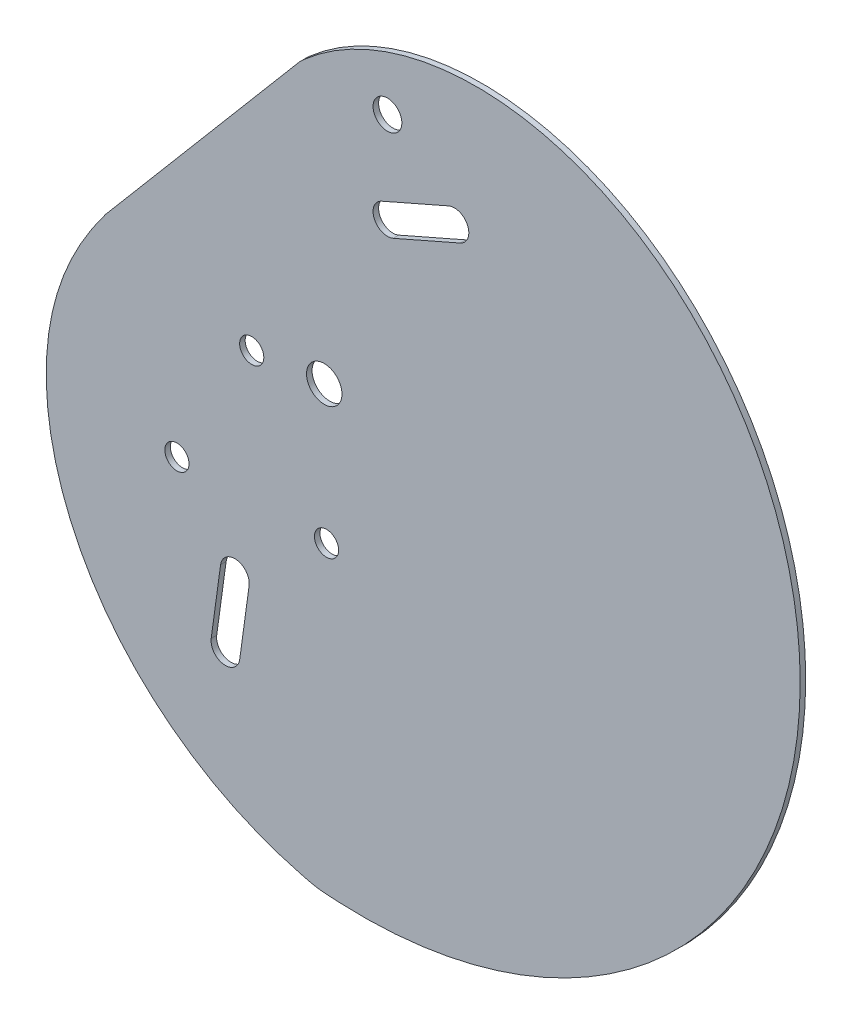
ISO-10303-21;
HEADER;
FILE_DESCRIPTION(('STEP AP214'),'2;1');
FILE_NAME('part.step','',(''),(''),'','','');
FILE_SCHEMA(('AUTOMOTIVE_DESIGN { 1 0 10303 214 1 1 1 1 }'));
ENDSEC;
DATA;
#1=APPLICATION_CONTEXT('core data for automotive mechanical design processes');
#2=APPLICATION_PROTOCOL_DEFINITION('international standard','automotive_design',2000,#1);
#3=PRODUCT_CONTEXT('',#1,'mechanical');
#4=PRODUCT('Part','Part','',(#3));
#5=PRODUCT_RELATED_PRODUCT_CATEGORY('part','',(#4));
#6=PRODUCT_DEFINITION_FORMATION('','',#4);
#7=PRODUCT_DEFINITION_CONTEXT('part definition',#1,'design');
#8=PRODUCT_DEFINITION('design','',#6,#7);
#9=PRODUCT_DEFINITION_SHAPE('','',#8);
#10=(LENGTH_UNIT() NAMED_UNIT(*) SI_UNIT(.MILLI.,.METRE.));
#11=(NAMED_UNIT(*) PLANE_ANGLE_UNIT() SI_UNIT($,.RADIAN.));
#12=(NAMED_UNIT(*) SI_UNIT($,.STERADIAN.) SOLID_ANGLE_UNIT());
#13=UNCERTAINTY_MEASURE_WITH_UNIT(LENGTH_MEASURE(1.E-05),#10,'distance_accuracy_value','');
#14=(GEOMETRIC_REPRESENTATION_CONTEXT(3) GLOBAL_UNCERTAINTY_ASSIGNED_CONTEXT((#13)) GLOBAL_UNIT_ASSIGNED_CONTEXT((#10,
#11,#12)) REPRESENTATION_CONTEXT('',''));
#15=CARTESIAN_POINT('',(0.,0.,0.));
#16=DIRECTION('',(0.,0.,1.));
#17=DIRECTION('',(1.,0.,0.));
#18=AXIS2_PLACEMENT_3D('',#15,#16,#17);
#19=CARTESIAN_POINT('',(-1.26128431869605,-76.3889966640853,0.479643116195787));
#20=CARTESIAN_POINT('',(-0.976706935574322,-76.433000958118,0.479643116195787));
#21=CARTESIAN_POINT('',(-0.40570033732491,-76.5002886734785,0.479643116195787));
#22=CARTESIAN_POINT('',(0.205282970299483,-76.5431286550552,0.479643116195787));
#23=CARTESIAN_POINT('',(0.635947632892369,-76.5659234882829,0.479643116195787));
#24=CARTESIAN_POINT('',(0.943803395898629,-76.5837536992732,0.479643116195787));
#25=CARTESIAN_POINT('',(1.51657766798327,-76.6253526449032,0.479643116195787));
#26=CARTESIAN_POINT('',(2.39472861708088,-76.6794226518138,0.479643116195787));
#27=CARTESIAN_POINT('',(3.1808192769605,-76.7137003743502,0.479643116195787));
#28=CARTESIAN_POINT('',(4.19803699961454,-76.75168724619,0.479643116195787));
#29=CARTESIAN_POINT('',(6.0521406389918,-76.7942720929503,0.479643116195787));
#30=CARTESIAN_POINT('',(8.65531896727179,-76.7757899651055,0.479643116195787));
#31=CARTESIAN_POINT('',(11.7992302850273,-76.631186753929,0.479643116195787));
#32=CARTESIAN_POINT('',(14.9308116076091,-76.362150817123,0.479643116195787));
#33=CARTESIAN_POINT('',(19.0927292822368,-75.8376989684194,0.479643116195787));
#34=CARTESIAN_POINT('',(24.2526003043896,-74.8709042385839,0.479643116195787));
#35=CARTESIAN_POINT('',(30.3366917936986,-73.2151665179252,0.479643116195787));
#36=CARTESIAN_POINT('',(38.2496377184228,-70.3553029330726,0.479643116195787));
#37=CARTESIAN_POINT('',(47.6646576679233,-65.5807106727296,0.479643116195787));
#38=CARTESIAN_POINT('',(57.8782405742599,-58.0526588499173,0.479643116195787));
#39=CARTESIAN_POINT('',(69.6472472290832,-45.8604490127679,0.479643116195787));
#40=CARTESIAN_POINT('',(80.1730162895738,-27.1334514768673,0.479643116195787));
#41=CARTESIAN_POINT('',(84.2538630410436,-1.50479165459522,0.479643116195787));
#42=CARTESIAN_POINT('',(79.5599947434369,19.8412067482863,0.479643116195787));
#43=CARTESIAN_POINT('',(70.8796865135484,34.9401638956233,0.479643116195787));
#44=CARTESIAN_POINT('',(62.021642873432,44.7053655266334,0.479643116195787));
#45=CARTESIAN_POINT('',(51.0907411074019,52.2640812116842,0.479643116195787));
#46=CARTESIAN_POINT('',(38.576471746608,57.0540859282341,0.479643116195787));
#47=CARTESIAN_POINT('',(25.1004774931715,58.5603822983813,0.479643116195787));
#48=CARTESIAN_POINT('',(13.7708368946147,56.6943293928139,0.479643116195787));
#49=CARTESIAN_POINT('',(5.22574400857566,53.179291685644,0.479643116195787));
#50=CARTESIAN_POINT('',(-0.75748548654271,49.5274645181489,0.479643116195787));
#51=CARTESIAN_POINT('',(-5.17982564226412,45.6481332259453,0.479643116195787));
#52=CARTESIAN_POINT('',(-8.21712868273601,42.3111233056651,0.479643116195787));
#53=CARTESIAN_POINT('',(-10.2837476793927,39.7285564460287,0.479643116195787));
#54=CARTESIAN_POINT('',(-12.1453981413637,37.1299230221057,0.479643116195787));
#55=CARTESIAN_POINT('',(-13.803593656072,34.6302202411006,0.479643116195787));
#56=CARTESIAN_POINT('',(-15.0263666385234,32.7872172676154,0.479643116195787));
#57=CARTESIAN_POINT('',(-15.757749026262,31.8150435741405,0.479643116195787));
#58=CARTESIAN_POINT('',(-16.4572837085939,31.0087975471452,0.479643116195787));
#59=CARTESIAN_POINT('',(-17.3148530430872,30.2124256121384,0.479643116195787));
#60=CARTESIAN_POINT('',(-18.8320987171928,29.1405411562789,0.479643116195787));
#61=CARTESIAN_POINT('',(-20.5794335453912,27.9210149954297,0.479643116195787));
#62=CARTESIAN_POINT('',(-21.8514483213816,26.9528121584477,0.479643116195787));
#63=CARTESIAN_POINT('',(-22.9229134864311,26.0255763335065,0.479643116195787));
#64=CARTESIAN_POINT('',(-23.9113330049711,25.0957745743073,0.479643116195787));
#65=CARTESIAN_POINT('',(-25.0438847891512,23.9057178105531,0.479643116195787));
#66=CARTESIAN_POINT('',(-26.2444451597005,22.4769501418682,0.479643116195787));
#67=CARTESIAN_POINT('',(-27.6678771544237,20.6032078316902,0.479643116195787));
#68=CARTESIAN_POINT('',(-29.1662720153948,18.3817060593167,0.479643116195787));
#69=CARTESIAN_POINT('',(-30.6820035254275,16.0304898055358,0.479643116195787));
#70=CARTESIAN_POINT('',(-31.8417450158577,14.3234191557175,0.479643116195787));
#71=CARTESIAN_POINT('',(-32.7929265221825,13.0258719381619,0.479643116195787));
#72=CARTESIAN_POINT('',(-33.7609917005133,11.7717771176703,0.479643116195787));
#73=CARTESIAN_POINT('',(-35.1935179417244,10.0318274989824,0.479643116195787));
#74=CARTESIAN_POINT('',(-37.0947743542895,7.68858611063458,0.479643116195787));
#75=CARTESIAN_POINT('',(-39.6505131759334,4.30610185058949,0.479643116195787));
#76=CARTESIAN_POINT('',(-42.6514237523282,-0.366044153239744,0.479643116195787));
#77=CARTESIAN_POINT('',(-45.5355557594005,-6.54725137287064,0.479643116195787));
#78=CARTESIAN_POINT('',(-47.5029702487626,-13.2116577754802,0.479643116195787));
#79=CARTESIAN_POINT('',(-48.6844974640878,-22.3699096817478,0.479643116195787));
#80=CARTESIAN_POINT('',(-47.6098868039418,-33.7322087237693,0.479643116195787));
#81=CARTESIAN_POINT('',(-42.8642408139455,-46.3451326435725,0.479643116195787));
#82=CARTESIAN_POINT('',(-36.5641298213063,-55.4680273522898,0.479643116195787));
#83=CARTESIAN_POINT('',(-30.4296575788591,-61.7275262732319,0.479643116195787));
#84=CARTESIAN_POINT('',(-25.3568115028753,-65.8672301951248,0.479643116195787));
#85=CARTESIAN_POINT('',(-20.7978951820845,-68.8298585097831,0.479643116195787));
#86=CARTESIAN_POINT('',(-16.9868888228126,-70.8972783811654,0.479643116195787));
#87=CARTESIAN_POINT('',(-14.0571261532245,-72.2940624730244,0.479643116195787));
#88=CARTESIAN_POINT('',(-11.0574897827893,-73.537247470639,0.479643116195787));
#89=CARTESIAN_POINT('',(-8.52863978148638,-74.4382486629739,0.479643116195787));
#90=CARTESIAN_POINT('',(-6.7053553577977,-75.0088395123344,0.479643116195787));
#91=CARTESIAN_POINT('',(-5.69991861950379,-75.3033007427362,0.479643116195787));
#92=CARTESIAN_POINT('',(-4.91466346108121,-75.5253296610727,0.479643116195787));
#93=CARTESIAN_POINT('',(-4.04372816904597,-75.7517503026063,0.479643116195787));
#94=CARTESIAN_POINT('',(-3.47701846483031,-75.8911528901832,0.479643116195787));
#95=CARTESIAN_POINT('',(-3.15620305968882,-75.9746877031505,0.479643116195787));
#96=CARTESIAN_POINT('',(-2.71872815087296,-76.0895979552755,0.479643116195787));
#97=CARTESIAN_POINT('',(-2.11316463605528,-76.2362629092826,0.479643116195787));
#98=CARTESIAN_POINT('',(-1.54586170181775,-76.3449923700527,0.479643116195787));
#99=CARTESIAN_POINT('',(-1.26128431869605,-76.3889966640853,0.479643116195787));
#100=B_SPLINE_CURVE_WITH_KNOTS('',3,(#19,#20,#21,#22,#23,#24,#25,#26,#27,#28,#29,#30,#31,#32,
#33,#34,#35,#36,#37,#38,#39,#40,#41,#42,#43,#44,#45,#46,#47,#48,#49,#50,#51,#52,#53,#54,#55,#56,
#57,#58,#59,#60,#61,#62,#63,#64,#65,#66,#67,#68,#69,#70,#71,#72,#73,#74,#75,#76,#77,#78,#79,#80,
#81,#82,#83,#84,#85,#86,#87,#88,#89,#90,#91,#92,#93,#94,#95,#96,#97,#98,#99),.UNSPECIFIED.,.T.,
.F.,(4,1,1,1,1,1,1,1,1,1,1,1,1,1,1,1,1,1,1,1,1,1,1,1,1,1,1,1,1,1,1,1,1,1,1,1,1,1,1,1,1,1,1,1,1,
1,1,1,1,1,1,1,1,1,1,1,1,1,1,1,1,1,1,1,1,1,1,1,1,1,1,1,1,1,1,1,1,1,4),(0.,0.0009765625,
0.001953125,0.0029296875,0.00390625,0.005859375,0.0078125,0.009765625,0.01171875,0.015625,
0.0234375,0.03125,0.0390625,0.046875,0.0625,0.078125,0.09375,0.125,0.15625,0.1875,0.25,0.3125,
0.375,0.40625,0.4375,0.46875,0.5,0.53125,0.5625,0.578125,0.59375,0.609375,0.6171875,0.625,
0.6328125,0.640625,0.6484375,0.65234375,0.65625,0.6640625,0.671875,0.67578125,0.6796875,
0.681640625,0.68359375,0.6875,0.69140625,0.6953125,0.703125,0.7109375,0.71875,0.72265625,
0.7265625,0.734375,0.7421875,0.75,0.765625,0.78125,0.796875,0.8125,0.84375,0.875,0.90625,
0.921875,0.9375,0.953125,0.9609375,0.96875,0.9765625,0.984375,0.98828125,0.990234375,0.9921875,
0.994140625,0.99609375,0.9970703125,0.998046875,0.9990234375,1.),.UNSPECIFIED.);
#101=DIRECTION('',(0.,0.,-1.));
#102=VECTOR('',#101,1.);
#103=SURFACE_OF_LINEAR_EXTRUSION('',#100,#102);
#104=CARTESIAN_POINT('',(-1.26128431869605,-76.3889966640853,-0.479643116195787));
#105=CARTESIAN_POINT('',(-0.976706935574322,-76.433000958118,-0.479643116195787));
#106=CARTESIAN_POINT('',(-0.40570033732491,-76.5002886734785,-0.479643116195787));
#107=CARTESIAN_POINT('',(0.205282970299483,-76.5431286550552,-0.479643116195787));
#108=CARTESIAN_POINT('',(0.635947632892369,-76.5659234882829,-0.479643116195787));
#109=CARTESIAN_POINT('',(0.943803395898629,-76.5837536992732,-0.479643116195787));
#110=CARTESIAN_POINT('',(1.51657766798327,-76.6253526449032,-0.479643116195787));
#111=CARTESIAN_POINT('',(2.39472861708088,-76.6794226518138,-0.479643116195787));
#112=CARTESIAN_POINT('',(3.1808192769605,-76.7137003743502,-0.479643116195787));
#113=CARTESIAN_POINT('',(4.19803699961454,-76.75168724619,-0.479643116195787));
#114=CARTESIAN_POINT('',(6.0521406389918,-76.7942720929503,-0.479643116195787));
#115=CARTESIAN_POINT('',(8.65531896727179,-76.7757899651055,-0.479643116195787));
#116=CARTESIAN_POINT('',(11.7992302850273,-76.631186753929,-0.479643116195787));
#117=CARTESIAN_POINT('',(14.9308116076091,-76.362150817123,-0.479643116195787));
#118=CARTESIAN_POINT('',(19.0927292822368,-75.8376989684194,-0.479643116195787));
#119=CARTESIAN_POINT('',(24.2526003043896,-74.8709042385839,-0.479643116195787));
#120=CARTESIAN_POINT('',(30.3366917936986,-73.2151665179252,-0.479643116195787));
#121=CARTESIAN_POINT('',(38.2496377184228,-70.3553029330726,-0.479643116195787));
#122=CARTESIAN_POINT('',(47.6646576679233,-65.5807106727296,-0.479643116195787));
#123=CARTESIAN_POINT('',(57.8782405742599,-58.0526588499173,-0.479643116195787));
#124=CARTESIAN_POINT('',(69.6472472290832,-45.8604490127679,-0.479643116195787));
#125=CARTESIAN_POINT('',(80.1730162895738,-27.1334514768673,-0.479643116195787));
#126=CARTESIAN_POINT('',(84.2538630410436,-1.50479165459522,-0.479643116195787));
#127=CARTESIAN_POINT('',(79.5599947434369,19.8412067482863,-0.479643116195787));
#128=CARTESIAN_POINT('',(70.8796865135484,34.9401638956233,-0.479643116195787));
#129=CARTESIAN_POINT('',(62.021642873432,44.7053655266334,-0.479643116195787));
#130=CARTESIAN_POINT('',(51.0907411074019,52.2640812116842,-0.479643116195787));
#131=CARTESIAN_POINT('',(38.576471746608,57.0540859282341,-0.479643116195787));
#132=CARTESIAN_POINT('',(25.1004774931715,58.5603822983813,-0.479643116195787));
#133=CARTESIAN_POINT('',(13.7708368946147,56.6943293928139,-0.479643116195787));
#134=CARTESIAN_POINT('',(5.22574400857566,53.179291685644,-0.479643116195787));
#135=CARTESIAN_POINT('',(-0.75748548654271,49.5274645181489,-0.479643116195787));
#136=CARTESIAN_POINT('',(-5.17982564226412,45.6481332259453,-0.479643116195787));
#137=CARTESIAN_POINT('',(-8.21712868273601,42.3111233056651,-0.479643116195787));
#138=CARTESIAN_POINT('',(-10.2837476793927,39.7285564460287,-0.479643116195787));
#139=CARTESIAN_POINT('',(-12.1453981413637,37.1299230221057,-0.479643116195787));
#140=CARTESIAN_POINT('',(-13.803593656072,34.6302202411006,-0.479643116195787));
#141=CARTESIAN_POINT('',(-15.0263666385234,32.7872172676154,-0.479643116195787));
#142=CARTESIAN_POINT('',(-15.757749026262,31.8150435741405,-0.479643116195787));
#143=CARTESIAN_POINT('',(-16.4572837085939,31.0087975471452,-0.479643116195787));
#144=CARTESIAN_POINT('',(-17.3148530430872,30.2124256121384,-0.479643116195787));
#145=CARTESIAN_POINT('',(-18.8320987171928,29.1405411562789,-0.479643116195787));
#146=CARTESIAN_POINT('',(-20.5794335453912,27.9210149954297,-0.479643116195787));
#147=CARTESIAN_POINT('',(-21.8514483213816,26.9528121584477,-0.479643116195787));
#148=CARTESIAN_POINT('',(-22.9229134864311,26.0255763335065,-0.479643116195787));
#149=CARTESIAN_POINT('',(-23.9113330049711,25.0957745743073,-0.479643116195787));
#150=CARTESIAN_POINT('',(-25.0438847891512,23.9057178105531,-0.479643116195787));
#151=CARTESIAN_POINT('',(-26.2444451597005,22.4769501418682,-0.479643116195787));
#152=CARTESIAN_POINT('',(-27.6678771544237,20.6032078316902,-0.479643116195787));
#153=CARTESIAN_POINT('',(-29.1662720153948,18.3817060593167,-0.479643116195787));
#154=CARTESIAN_POINT('',(-30.6820035254275,16.0304898055358,-0.479643116195787));
#155=CARTESIAN_POINT('',(-31.8417450158577,14.3234191557175,-0.479643116195787));
#156=CARTESIAN_POINT('',(-32.7929265221825,13.0258719381619,-0.479643116195787));
#157=CARTESIAN_POINT('',(-33.7609917005133,11.7717771176703,-0.479643116195787));
#158=CARTESIAN_POINT('',(-35.1935179417244,10.0318274989824,-0.479643116195787));
#159=CARTESIAN_POINT('',(-37.0947743542895,7.68858611063458,-0.479643116195787));
#160=CARTESIAN_POINT('',(-39.6505131759334,4.30610185058949,-0.479643116195787));
#161=CARTESIAN_POINT('',(-42.6514237523282,-0.366044153239744,-0.479643116195787));
#162=CARTESIAN_POINT('',(-45.5355557594005,-6.54725137287064,-0.479643116195787));
#163=CARTESIAN_POINT('',(-47.5029702487626,-13.2116577754802,-0.479643116195787));
#164=CARTESIAN_POINT('',(-48.6844974640878,-22.3699096817478,-0.479643116195787));
#165=CARTESIAN_POINT('',(-47.6098868039418,-33.7322087237693,-0.479643116195787));
#166=CARTESIAN_POINT('',(-42.8642408139455,-46.3451326435725,-0.479643116195787));
#167=CARTESIAN_POINT('',(-36.5641298213063,-55.4680273522898,-0.479643116195787));
#168=CARTESIAN_POINT('',(-30.4296575788591,-61.7275262732319,-0.479643116195787));
#169=CARTESIAN_POINT('',(-25.3568115028753,-65.8672301951248,-0.479643116195787));
#170=CARTESIAN_POINT('',(-20.7978951820845,-68.8298585097831,-0.479643116195787));
#171=CARTESIAN_POINT('',(-16.9868888228126,-70.8972783811654,-0.479643116195787));
#172=CARTESIAN_POINT('',(-14.0571261532245,-72.2940624730244,-0.479643116195787));
#173=CARTESIAN_POINT('',(-11.0574897827893,-73.537247470639,-0.479643116195787));
#174=CARTESIAN_POINT('',(-8.52863978148638,-74.4382486629739,-0.479643116195787));
#175=CARTESIAN_POINT('',(-6.7053553577977,-75.0088395123344,-0.479643116195787));
#176=CARTESIAN_POINT('',(-5.69991861950379,-75.3033007427362,-0.479643116195787));
#177=CARTESIAN_POINT('',(-4.91466346108121,-75.5253296610727,-0.479643116195787));
#178=CARTESIAN_POINT('',(-4.04372816904597,-75.7517503026063,-0.479643116195787));
#179=CARTESIAN_POINT('',(-3.47701846483031,-75.8911528901832,-0.479643116195787));
#180=CARTESIAN_POINT('',(-3.15620305968882,-75.9746877031505,-0.479643116195787));
#181=CARTESIAN_POINT('',(-2.71872815087296,-76.0895979552755,-0.479643116195787));
#182=CARTESIAN_POINT('',(-2.11316463605528,-76.2362629092826,-0.479643116195787));
#183=CARTESIAN_POINT('',(-1.54586170181775,-76.3449923700527,-0.479643116195787));
#184=CARTESIAN_POINT('',(-1.26128431869605,-76.3889966640853,-0.479643116195787));
#185=B_SPLINE_CURVE_WITH_KNOTS('',3,(#104,#105,#106,#107,#108,#109,#110,#111,#112,#113,#114,
#115,#116,#117,#118,#119,#120,#121,#122,#123,#124,#125,#126,#127,#128,#129,#130,#131,#132,#133,
#134,#135,#136,#137,#138,#139,#140,#141,#142,#143,#144,#145,#146,#147,#148,#149,#150,#151,#152,
#153,#154,#155,#156,#157,#158,#159,#160,#161,#162,#163,#164,#165,#166,#167,#168,#169,#170,#171,
#172,#173,#174,#175,#176,#177,#178,#179,#180,#181,#182,#183,#184),.UNSPECIFIED.,.T.,.F.,(4,1,1,
1,1,1,1,1,1,1,1,1,1,1,1,1,1,1,1,1,1,1,1,1,1,1,1,1,1,1,1,1,1,1,1,1,1,1,1,1,1,1,1,1,1,1,1,1,1,1,1,
1,1,1,1,1,1,1,1,1,1,1,1,1,1,1,1,1,1,1,1,1,1,1,1,1,1,1,4),(0.,0.0009765625,0.001953125,
0.0029296875,0.00390625,0.005859375,0.0078125,0.009765625,0.01171875,0.015625,0.0234375,0.03125,
0.0390625,0.046875,0.0625,0.078125,0.09375,0.125,0.15625,0.1875,0.25,0.3125,0.375,0.40625,
0.4375,0.46875,0.5,0.53125,0.5625,0.578125,0.59375,0.609375,0.6171875,0.625,0.6328125,0.640625,
0.6484375,0.65234375,0.65625,0.6640625,0.671875,0.67578125,0.6796875,0.681640625,0.68359375,
0.6875,0.69140625,0.6953125,0.703125,0.7109375,0.71875,0.72265625,0.7265625,0.734375,0.7421875,
0.75,0.765625,0.78125,0.796875,0.8125,0.84375,0.875,0.90625,0.921875,0.9375,0.953125,0.9609375,
0.96875,0.9765625,0.984375,0.98828125,0.990234375,0.9921875,0.994140625,0.99609375,0.9970703125,
0.998046875,0.9990234375,1.),.UNSPECIFIED.);
#186=CARTESIAN_POINT('',(-37.9799857120954,6.50792390325195,-0.479643116195787));
#187=VERTEX_POINT('',#186);
#188=CARTESIAN_POINT('',(-3.53695857470602,47.0282576025844,-0.479643116195787));
#189=VERTEX_POINT('',#188);
#190=EDGE_CURVE('E255',#187,#189,#185,.T.);
#191=ORIENTED_EDGE('',*,*,#190,.T.);
#192=DIRECTION('',(0.,0.,-1.));
#193=VECTOR('',#192,1.);
#194=CARTESIAN_POINT('',(-3.53695857470602,47.0282576025844,-0.479643116195787));
#195=LINE('',#194,#193);
#196=CARTESIAN_POINT('',(-3.53695857470602,47.0282576025844,0.479643116195787));
#197=VERTEX_POINT('',#196);
#198=EDGE_CURVE('E349',#189,#197,#195,.F.);
#199=ORIENTED_EDGE('',*,*,#198,.T.);
#200=CARTESIAN_POINT('',(-37.9799857120954,6.50792390325195,0.479643116195787));
#201=VERTEX_POINT('',#200);
#202=EDGE_CURVE('E256',#201,#197,#100,.T.);
#203=ORIENTED_EDGE('',*,*,#202,.F.);
#204=DIRECTION('',(0.,0.,1.));
#205=VECTOR('',#204,1.);
#206=CARTESIAN_POINT('',(-37.9799857120954,6.50792390325195,-0.479643116195787));
#207=LINE('',#206,#205);
#208=EDGE_CURVE('E251',#187,#201,#207,.T.);
#209=ORIENTED_EDGE('',*,*,#208,.F.);
#210=EDGE_LOOP('',(#191,#199,#203,#209));
#211=FACE_BOUND('',#210,.T.);
#212=ADVANCED_FACE('F41',(#211),#103,.F.);
#213=CARTESIAN_POINT('',(0.,0.,0.479643116195787));
#214=DIRECTION('',(0.,0.,1.));
#215=DIRECTION('',(1.,0.,0.));
#216=AXIS2_PLACEMENT_3D('',#213,#214,#215);
#217=PLANE('',#216);
#218=CARTESIAN_POINT('',(-15.5246550842069,-36.5419843367977,0.479643116195787));
#219=DIRECTION('',(0.,0.,1.));
#220=DIRECTION('',(1.,0.,0.));
#221=AXIS2_PLACEMENT_3D('',#218,#219,#220);
#222=CIRCLE('',#221,2.5);
#223=CARTESIAN_POINT('',(-13.0478200492769,-36.881525512126,0.479643116195787));
#224=VERTEX_POINT('',#223);
#225=CARTESIAN_POINT('',(-18.0014901191369,-36.2024431614693,0.479643116195787));
#226=VERTEX_POINT('',#225);
#227=EDGE_CURVE('E57',#224,#226,#222,.T.);
#228=ORIENTED_EDGE('',*,*,#227,.F.);
#229=DIRECTION('',(0.135816470131342,0.990734013971996,0.));
#230=VECTOR('',#229,1.);
#231=CARTESIAN_POINT('',(-13.0478200492769,-36.881525512126,0.479643116195787));
#232=LINE('',#231,#230);
#233=CARTESIAN_POINT('',(-14.677617690853,-48.77033367979,0.479643116195787));
#234=VERTEX_POINT('',#233);
#235=EDGE_CURVE('E199',#234,#224,#232,.T.);
#236=ORIENTED_EDGE('',*,*,#235,.F.);
#237=CARTESIAN_POINT('',(-17.154452725783,-48.4307925044616,0.479643116195787));
#238=DIRECTION('',(0.,0.,1.));
#239=DIRECTION('',(1.,0.,0.));
#240=AXIS2_PLACEMENT_3D('',#237,#238,#239);
#241=CIRCLE('',#240,2.5);
#242=CARTESIAN_POINT('',(-19.631287760713,-48.0912513291333,0.479643116195787));
#243=VERTEX_POINT('',#242);
#244=EDGE_CURVE('E195',#243,#234,#241,.T.);
#245=ORIENTED_EDGE('',*,*,#244,.F.);
#246=DIRECTION('',(-0.135816470131342,-0.990734013971996,0.));
#247=VECTOR('',#246,1.);
#248=CARTESIAN_POINT('',(-18.0014901191369,-36.2024431614693,0.479643116195787));
#249=LINE('',#248,#247);
#250=EDGE_CURVE('E191',#226,#243,#249,.T.);
#251=ORIENTED_EDGE('',*,*,#250,.F.);
#252=EDGE_LOOP('',(#228,#236,#245,#251));
#253=FACE_BOUND('',#252,.T.);
#254=CARTESIAN_POINT('',(10.9804815621746,45.9900244881096,0.479643116195787));
#255=DIRECTION('',(0.,0.,1.));
#256=DIRECTION('',(1.,0.,0.));
#257=AXIS2_PLACEMENT_3D('',#254,#255,#256);
#258=CIRCLE('',#257,2.5);
#259=CARTESIAN_POINT('',(13.4804815621746,45.9900244881096,0.479643116195787));
#260=VERTEX_POINT('',#259);
#261=EDGE_CURVE('E169',#260,#260,#258,.T.);
#262=ORIENTED_EDGE('',*,*,#261,.F.);
#263=EDGE_LOOP('',(#262));
#264=FACE_BOUND('',#263,.T.);
#265=CARTESIAN_POINT('',(10.9804815621746,30.1850817692675,0.479643116195787));
#266=DIRECTION('',(0.,0.,1.));
#267=DIRECTION('',(1.,0.,0.));
#268=AXIS2_PLACEMENT_3D('',#265,#266,#267);
#269=CIRCLE('',#268,2.5);
#270=CARTESIAN_POINT('',(9.97604894369542,32.474429954873,0.479643116195787));
#271=VERTEX_POINT('',#270);
#272=CARTESIAN_POINT('',(11.9849141806538,27.895733583662,0.479643116195787));
#273=VERTEX_POINT('',#272);
#274=EDGE_CURVE('E65',#271,#273,#269,.T.);
#275=ORIENTED_EDGE('',*,*,#274,.F.);
#276=DIRECTION('',(-0.915739274242188,-0.401773047391673,0.));
#277=VECTOR('',#276,1.);
#278=CARTESIAN_POINT('',(9.97604894369542,32.474429954873,0.479643116195787));
#279=LINE('',#278,#277);
#280=CARTESIAN_POINT('',(21.6059377265712,37.5769476567472,0.479643116195787));
#281=VERTEX_POINT('',#280);
#282=EDGE_CURVE('E150',#281,#271,#279,.T.);
#283=ORIENTED_EDGE('',*,*,#282,.F.);
#284=CARTESIAN_POINT('',(22.6103703450504,35.2875994711417,0.479643116195787));
#285=DIRECTION('',(0.,0.,1.));
#286=DIRECTION('',(1.,0.,0.));
#287=AXIS2_PLACEMENT_3D('',#284,#285,#286);
#288=CIRCLE('',#287,2.5);
#289=CARTESIAN_POINT('',(23.6148029635295,32.9982512855363,0.479643116195787));
#290=VERTEX_POINT('',#289);
#291=EDGE_CURVE('E131',#290,#281,#288,.T.);
#292=ORIENTED_EDGE('',*,*,#291,.F.);
#293=DIRECTION('',(0.915739274242188,0.401773047391673,0.));
#294=VECTOR('',#293,1.);
#295=CARTESIAN_POINT('',(11.9849141806538,27.895733583662,0.479643116195787));
#296=LINE('',#295,#294);
#297=EDGE_CURVE('E142',#273,#290,#296,.T.);
#298=ORIENTED_EDGE('',*,*,#297,.F.);
#299=EDGE_LOOP('',(#275,#283,#292,#298));
#300=FACE_BOUND('',#299,.T.);
#301=CARTESIAN_POINT('',(0.,0.,0.479643116195787));
#302=DIRECTION('',(0.,0.,1.));
#303=DIRECTION('',(1.,0.,0.));
#304=AXIS2_PLACEMENT_3D('',#301,#302,#303);
#305=CIRCLE('',#304,3.075);
#306=CARTESIAN_POINT('',(3.075,0.,0.479643116195787));
#307=VERTEX_POINT('',#306);
#308=EDGE_CURVE('E167',#307,#307,#305,.T.);
#309=ORIENTED_EDGE('',*,*,#308,.F.);
#310=EDGE_LOOP('',(#309));
#311=FACE_BOUND('',#310,.T.);
#312=CARTESIAN_POINT('',(-12.5939001772955,-1.27258597502269,0.479643116195787));
#313=DIRECTION('',(0.,0.,1.));
#314=DIRECTION('',(1.,0.,0.));
#315=AXIS2_PLACEMENT_3D('',#312,#313,#314);
#316=CIRCLE('',#315,2.1);
#317=CARTESIAN_POINT('',(-10.4939001772955,-1.27258597502269,0.479643116195787));
#318=VERTEX_POINT('',#317);
#319=EDGE_CURVE('E223',#318,#318,#316,.T.);
#320=ORIENTED_EDGE('',*,*,#319,.F.);
#321=EDGE_LOOP('',(#320));
#322=FACE_BOUND('',#321,.T.);
#323=CARTESIAN_POINT('',(0.396480879471766,-23.7725859750223,0.479643116195787));
#324=DIRECTION('',(0.,0.,1.));
#325=DIRECTION('',(1.,0.,0.));
#326=AXIS2_PLACEMENT_3D('',#323,#324,#325);
#327=CIRCLE('',#326,2.1);
#328=CARTESIAN_POINT('',(2.49648087947177,-23.7725859750223,0.479643116195787));
#329=VERTEX_POINT('',#328);
#330=EDGE_CURVE('E231',#329,#329,#327,.T.);
#331=ORIENTED_EDGE('',*,*,#330,.F.);
#332=EDGE_LOOP('',(#331));
#333=FACE_BOUND('',#332,.T.);
#334=CARTESIAN_POINT('',(-25.5842812340614,-23.7725859750231,0.479643116195787));
#335=DIRECTION('',(0.,0.,1.));
#336=DIRECTION('',(1.,0.,0.));
#337=AXIS2_PLACEMENT_3D('',#334,#335,#336);
#338=CIRCLE('',#337,2.1);
#339=CARTESIAN_POINT('',(-23.4842812340614,-23.7725859750231,0.479643116195787));
#340=VERTEX_POINT('',#339);
#341=EDGE_CURVE('E239',#340,#340,#338,.T.);
#342=ORIENTED_EDGE('',*,*,#341,.F.);
#343=EDGE_LOOP('',(#342));
#344=FACE_BOUND('',#343,.T.);
#345=ORIENTED_EDGE('',*,*,#202,.T.);
#346=CARTESIAN_POINT('',(3.06845796283442,39.5203635992312,0.479643116195787));
#347=DIRECTION('',(0.,0.,1.));
#348=DIRECTION('',(1.,0.,0.));
#349=AXIS2_PLACEMENT_3D('',#346,#347,#348);
#350=CIRCLE('',#349,10.);
#351=CARTESIAN_POINT('',(-4.56394467477296,45.9815113283459,0.479643116195787));
#352=VERTEX_POINT('',#351);
#353=EDGE_CURVE('E352',#197,#352,#350,.T.);
#354=ORIENTED_EDGE('',*,*,#353,.T.);
#355=DIRECTION('',(0.64611477291147,0.763240263760737,0.));
#356=VECTOR('',#355,1.);
#357=CARTESIAN_POINT('',(-4.11931026186588,46.506747556973,0.479643116195787));
#358=LINE('',#357,#356);
#359=EDGE_CURVE('E247',#201,#352,#358,.T.);
#360=ORIENTED_EDGE('',*,*,#359,.F.);
#361=EDGE_LOOP('',(#345,#354,#360));
#362=FACE_BOUND('',#361,.T.);
#363=ADVANCED_FACE('F147',(#253,#264,#300,#311,#322,#333,#344,#362),#217,.T.);
#364=CARTESIAN_POINT('',(0.,0.,-0.479643116195787));
#365=DIRECTION('',(0.,0.,1.));
#366=DIRECTION('',(1.,0.,0.));
#367=AXIS2_PLACEMENT_3D('',#364,#365,#366);
#368=PLANE('',#367);
#369=DIRECTION('',(-0.135816470131342,-0.990734013971996,0.));
#370=VECTOR('',#369,1.);
#371=CARTESIAN_POINT('',(-13.0478200492769,-36.881525512126,-0.479643116195787));
#372=LINE('',#371,#370);
#373=CARTESIAN_POINT('',(-13.0478200492769,-36.881525512126,-0.479643116195787));
#374=VERTEX_POINT('',#373);
#375=CARTESIAN_POINT('',(-14.677617690853,-48.77033367979,-0.479643116195787));
#376=VERTEX_POINT('',#375);
#377=EDGE_CURVE('E182',#374,#376,#372,.T.);
#378=ORIENTED_EDGE('',*,*,#377,.F.);
#379=CARTESIAN_POINT('',(-15.5246550842069,-36.5419843367977,-0.479643116195787));
#380=DIRECTION('',(0.,0.,1.));
#381=DIRECTION('',(1.,0.,0.));
#382=AXIS2_PLACEMENT_3D('',#379,#380,#381);
#383=CIRCLE('',#382,2.5);
#384=CARTESIAN_POINT('',(-18.0014901191369,-36.2024431614693,-0.479643116195787));
#385=VERTEX_POINT('',#384);
#386=EDGE_CURVE('E186',#385,#374,#383,.F.);
#387=ORIENTED_EDGE('',*,*,#386,.F.);
#388=DIRECTION('',(0.135816470131342,0.990734013971996,0.));
#389=VECTOR('',#388,1.);
#390=CARTESIAN_POINT('',(-18.0014901191369,-36.2024431614693,-0.479643116195787));
#391=LINE('',#390,#389);
#392=CARTESIAN_POINT('',(-19.631287760713,-48.0912513291333,-0.479643116195787));
#393=VERTEX_POINT('',#392);
#394=EDGE_CURVE('E174',#393,#385,#391,.T.);
#395=ORIENTED_EDGE('',*,*,#394,.F.);
#396=CARTESIAN_POINT('',(-17.154452725783,-48.4307925044616,-0.479643116195787));
#397=DIRECTION('',(0.,0.,1.));
#398=DIRECTION('',(1.,0.,0.));
#399=AXIS2_PLACEMENT_3D('',#396,#397,#398);
#400=CIRCLE('',#399,2.5);
#401=EDGE_CURVE('E178',#376,#393,#400,.F.);
#402=ORIENTED_EDGE('',*,*,#401,.F.);
#403=EDGE_LOOP('',(#378,#387,#395,#402));
#404=FACE_BOUND('',#403,.T.);
#405=CARTESIAN_POINT('',(10.9804815621746,45.9900244881096,-0.479643116195787));
#406=DIRECTION('',(0.,0.,1.));
#407=DIRECTION('',(1.,0.,0.));
#408=AXIS2_PLACEMENT_3D('',#405,#406,#407);
#409=CIRCLE('',#408,2.5);
#410=CARTESIAN_POINT('',(13.4804815621746,45.9900244881096,-0.479643116195787));
#411=VERTEX_POINT('',#410);
#412=EDGE_CURVE('E173',#411,#411,#409,.F.);
#413=ORIENTED_EDGE('',*,*,#412,.F.);
#414=EDGE_LOOP('',(#413));
#415=FACE_BOUND('',#414,.T.);
#416=DIRECTION('',(0.915739274242188,0.401773047391673,0.));
#417=VECTOR('',#416,1.);
#418=CARTESIAN_POINT('',(9.97604894369542,32.474429954873,-0.479643116195787));
#419=LINE('',#418,#417);
#420=CARTESIAN_POINT('',(9.97604894369542,32.474429954873,-0.479643116195787));
#421=VERTEX_POINT('',#420);
#422=CARTESIAN_POINT('',(21.6059377265712,37.5769476567472,-0.479643116195787));
#423=VERTEX_POINT('',#422);
#424=EDGE_CURVE('E333',#421,#423,#419,.T.);
#425=ORIENTED_EDGE('',*,*,#424,.F.);
#426=CARTESIAN_POINT('',(10.9804815621746,30.1850817692675,-0.479643116195787));
#427=DIRECTION('',(0.,0.,1.));
#428=DIRECTION('',(1.,0.,0.));
#429=AXIS2_PLACEMENT_3D('',#426,#427,#428);
#430=CIRCLE('',#429,2.5);
#431=CARTESIAN_POINT('',(11.9849141806538,27.895733583662,-0.479643116195787));
#432=VERTEX_POINT('',#431);
#433=EDGE_CURVE('E168',#432,#421,#430,.F.);
#434=ORIENTED_EDGE('',*,*,#433,.F.);
#435=DIRECTION('',(-0.915739274242188,-0.401773047391673,0.));
#436=VECTOR('',#435,1.);
#437=CARTESIAN_POINT('',(11.9849141806538,27.895733583662,-0.479643116195787));
#438=LINE('',#437,#436);
#439=CARTESIAN_POINT('',(23.6148029635295,32.9982512855363,-0.479643116195787));
#440=VERTEX_POINT('',#439);
#441=EDGE_CURVE('E164',#440,#432,#438,.T.);
#442=ORIENTED_EDGE('',*,*,#441,.F.);
#443=CARTESIAN_POINT('',(22.6103703450504,35.2875994711417,-0.479643116195787));
#444=DIRECTION('',(0.,0.,1.));
#445=DIRECTION('',(1.,0.,0.));
#446=AXIS2_PLACEMENT_3D('',#443,#444,#445);
#447=CIRCLE('',#446,2.5);
#448=EDGE_CURVE('E134',#423,#440,#447,.F.);
#449=ORIENTED_EDGE('',*,*,#448,.F.);
#450=EDGE_LOOP('',(#425,#434,#442,#449));
#451=FACE_BOUND('',#450,.T.);
#452=CARTESIAN_POINT('',(0.,0.,-0.479643116195787));
#453=DIRECTION('',(0.,0.,1.));
#454=DIRECTION('',(1.,0.,0.));
#455=AXIS2_PLACEMENT_3D('',#452,#453,#454);
#456=CIRCLE('',#455,3.075);
#457=CARTESIAN_POINT('',(3.075,0.,-0.479643116195787));
#458=VERTEX_POINT('',#457);
#459=EDGE_CURVE('E219',#458,#458,#456,.F.);
#460=ORIENTED_EDGE('',*,*,#459,.F.);
#461=EDGE_LOOP('',(#460));
#462=FACE_BOUND('',#461,.T.);
#463=CARTESIAN_POINT('',(-12.5939001772955,-1.27258597502269,-0.479643116195787));
#464=DIRECTION('',(0.,0.,1.));
#465=DIRECTION('',(1.,0.,0.));
#466=AXIS2_PLACEMENT_3D('',#463,#464,#465);
#467=CIRCLE('',#466,2.1);
#468=CARTESIAN_POINT('',(-10.4939001772955,-1.27258597502269,-0.479643116195787));
#469=VERTEX_POINT('',#468);
#470=EDGE_CURVE('E227',#469,#469,#467,.T.);
#471=ORIENTED_EDGE('',*,*,#470,.T.);
#472=EDGE_LOOP('',(#471));
#473=FACE_BOUND('',#472,.T.);
#474=CARTESIAN_POINT('',(0.396480879471766,-23.7725859750223,-0.479643116195787));
#475=DIRECTION('',(0.,0.,1.));
#476=DIRECTION('',(1.,0.,0.));
#477=AXIS2_PLACEMENT_3D('',#474,#475,#476);
#478=CIRCLE('',#477,2.1);
#479=CARTESIAN_POINT('',(2.49648087947177,-23.7725859750223,-0.479643116195787));
#480=VERTEX_POINT('',#479);
#481=EDGE_CURVE('E235',#480,#480,#478,.T.);
#482=ORIENTED_EDGE('',*,*,#481,.T.);
#483=EDGE_LOOP('',(#482));
#484=FACE_BOUND('',#483,.T.);
#485=CARTESIAN_POINT('',(-25.5842812340614,-23.7725859750231,-0.479643116195787));
#486=DIRECTION('',(0.,0.,1.));
#487=DIRECTION('',(1.,0.,0.));
#488=AXIS2_PLACEMENT_3D('',#485,#486,#487);
#489=CIRCLE('',#488,2.1);
#490=CARTESIAN_POINT('',(-23.4842812340614,-23.7725859750231,-0.479643116195787));
#491=VERTEX_POINT('',#490);
#492=EDGE_CURVE('E243',#491,#491,#489,.T.);
#493=ORIENTED_EDGE('',*,*,#492,.T.);
#494=EDGE_LOOP('',(#493));
#495=FACE_BOUND('',#494,.T.);
#496=DIRECTION('',(0.64611477291147,0.763240263760737,0.));
#497=VECTOR('',#496,1.);
#498=CARTESIAN_POINT('',(-25.3340204344462,21.4463068015867,-0.479643116195787));
#499=LINE('',#498,#497);
#500=CARTESIAN_POINT('',(-4.56394467477296,45.9815113283459,-0.479643116195787));
#501=VERTEX_POINT('',#500);
#502=EDGE_CURVE('E263',#187,#501,#499,.T.);
#503=ORIENTED_EDGE('',*,*,#502,.T.);
#504=CARTESIAN_POINT('',(3.06845796283442,39.5203635992312,-0.479643116195787));
#505=DIRECTION('',(0.,0.,1.));
#506=DIRECTION('',(1.,0.,0.));
#507=AXIS2_PLACEMENT_3D('',#504,#505,#506);
#508=CIRCLE('',#507,10.);
#509=EDGE_CURVE('E11',#501,#189,#508,.F.);
#510=ORIENTED_EDGE('',*,*,#509,.T.);
#511=ORIENTED_EDGE('',*,*,#190,.F.);
#512=EDGE_LOOP('',(#503,#510,#511));
#513=FACE_BOUND('',#512,.T.);
#514=ADVANCED_FACE('F273',(#404,#415,#451,#462,#473,#484,#495,#513),#368,.F.);
#515=CARTESIAN_POINT('',(-4.11931026186588,46.506747556973,-0.479643116195787));
#516=DIRECTION('',(0.763240263760737,-0.64611477291147,0.));
#517=DIRECTION('',(0.64611477291147,0.763240263760737,0.));
#518=AXIS2_PLACEMENT_3D('',#515,#516,#517);
#519=PLANE('',#518);
#520=ORIENTED_EDGE('',*,*,#359,.T.);
#521=DIRECTION('',(0.,0.,-1.));
#522=VECTOR('',#521,1.);
#523=CARTESIAN_POINT('',(-4.56394467477296,45.9815113283459,-0.479643116195787));
#524=LINE('',#523,#522);
#525=EDGE_CURVE('E50',#352,#501,#524,.T.);
#526=ORIENTED_EDGE('',*,*,#525,.T.);
#527=ORIENTED_EDGE('',*,*,#502,.F.);
#528=ORIENTED_EDGE('',*,*,#208,.T.);
#529=EDGE_LOOP('',(#520,#526,#527,#528));
#530=FACE_BOUND('',#529,.T.);
#531=ADVANCED_FACE('F276',(#530),#519,.F.);
#532=CARTESIAN_POINT('',(-25.5842812340614,-23.7725859750231,0.479643116195787));
#533=DIRECTION('',(0.,0.,1.));
#534=DIRECTION('',(1.,0.,0.));
#535=AXIS2_PLACEMENT_3D('',#532,#533,#534);
#536=CYLINDRICAL_SURFACE('',#535,2.1);
#537=ORIENTED_EDGE('',*,*,#492,.F.);
#538=EDGE_LOOP('',(#537));
#539=FACE_BOUND('',#538,.T.);
#540=ORIENTED_EDGE('',*,*,#341,.T.);
#541=EDGE_LOOP('',(#540));
#542=FACE_BOUND('',#541,.T.);
#543=ADVANCED_FACE('F283',(#539,#542),#536,.F.);
#544=CARTESIAN_POINT('',(0.396480879471766,-23.7725859750223,0.479643116195787));
#545=DIRECTION('',(0.,0.,1.));
#546=DIRECTION('',(1.,0.,0.));
#547=AXIS2_PLACEMENT_3D('',#544,#545,#546);
#548=CYLINDRICAL_SURFACE('',#547,2.1);
#549=ORIENTED_EDGE('',*,*,#481,.F.);
#550=EDGE_LOOP('',(#549));
#551=FACE_BOUND('',#550,.T.);
#552=ORIENTED_EDGE('',*,*,#330,.T.);
#553=EDGE_LOOP('',(#552));
#554=FACE_BOUND('',#553,.T.);
#555=ADVANCED_FACE('F287',(#551,#554),#548,.F.);
#556=CARTESIAN_POINT('',(-12.5939001772955,-1.27258597502269,0.479643116195787));
#557=DIRECTION('',(0.,0.,1.));
#558=DIRECTION('',(1.,0.,0.));
#559=AXIS2_PLACEMENT_3D('',#556,#557,#558);
#560=CYLINDRICAL_SURFACE('',#559,2.1);
#561=ORIENTED_EDGE('',*,*,#470,.F.);
#562=EDGE_LOOP('',(#561));
#563=FACE_BOUND('',#562,.T.);
#564=ORIENTED_EDGE('',*,*,#319,.T.);
#565=EDGE_LOOP('',(#564));
#566=FACE_BOUND('',#565,.T.);
#567=ADVANCED_FACE('F291',(#563,#566),#560,.F.);
#568=CARTESIAN_POINT('',(3.06845796283442,39.5203635992312,0.));
#569=DIRECTION('',(0.,0.,-1.));
#570=DIRECTION('',(-1.,0.,0.));
#571=AXIS2_PLACEMENT_3D('',#568,#569,#570);
#572=CYLINDRICAL_SURFACE('',#571,10.);
#573=ORIENTED_EDGE('',*,*,#509,.F.);
#574=ORIENTED_EDGE('',*,*,#525,.F.);
#575=ORIENTED_EDGE('',*,*,#353,.F.);
#576=ORIENTED_EDGE('',*,*,#198,.F.);
#577=EDGE_LOOP('',(#573,#574,#575,#576));
#578=FACE_BOUND('',#577,.T.);
#579=ADVANCED_FACE('F43',(#578),#572,.T.);
#580=CARTESIAN_POINT('',(0.,0.,-19.9376508468834));
#581=DIRECTION('',(0.,0.,1.));
#582=DIRECTION('',(1.,0.,0.));
#583=AXIS2_PLACEMENT_3D('',#580,#581,#582);
#584=CYLINDRICAL_SURFACE('',#583,3.075);
#585=ORIENTED_EDGE('',*,*,#459,.T.);
#586=EDGE_LOOP('',(#585));
#587=FACE_BOUND('',#586,.T.);
#588=ORIENTED_EDGE('',*,*,#308,.T.);
#589=EDGE_LOOP('',(#588));
#590=FACE_BOUND('',#589,.T.);
#591=ADVANCED_FACE('F296',(#587,#590),#584,.F.);
#592=CARTESIAN_POINT('',(10.9804815621746,30.1850817692675,-19.9376508468834));
#593=DIRECTION('',(0.,0.,1.));
#594=DIRECTION('',(1.,0.,0.));
#595=AXIS2_PLACEMENT_3D('',#592,#593,#594);
#596=CYLINDRICAL_SURFACE('',#595,2.5);
#597=ORIENTED_EDGE('',*,*,#433,.T.);
#598=DIRECTION('',(0.,0.,1.));
#599=VECTOR('',#598,1.);
#600=CARTESIAN_POINT('',(9.97604894369542,32.474429954873,-19.9376508468834));
#601=LINE('',#600,#599);
#602=EDGE_CURVE('E157',#421,#271,#601,.T.);
#603=ORIENTED_EDGE('',*,*,#602,.T.);
#604=ORIENTED_EDGE('',*,*,#274,.T.);
#605=DIRECTION('',(0.,0.,1.));
#606=VECTOR('',#605,1.);
#607=CARTESIAN_POINT('',(11.9849141806538,27.895733583662,-19.9376508468834));
#608=LINE('',#607,#606);
#609=EDGE_CURVE('E139',#432,#273,#608,.T.);
#610=ORIENTED_EDGE('',*,*,#609,.F.);
#611=EDGE_LOOP('',(#597,#603,#604,#610));
#612=FACE_BOUND('',#611,.T.);
#613=ADVANCED_FACE('F299',(#612),#596,.F.);
#614=CARTESIAN_POINT('',(9.97604894369542,32.474429954873,-19.9376508468834));
#615=DIRECTION('',(-0.401773047391673,0.915739274242188,0.));
#616=DIRECTION('',(-0.915739274242188,-0.401773047391673,0.));
#617=AXIS2_PLACEMENT_3D('',#614,#615,#616);
#618=PLANE('',#617);
#619=ORIENTED_EDGE('',*,*,#424,.T.);
#620=DIRECTION('',(0.,0.,1.));
#621=VECTOR('',#620,1.);
#622=CARTESIAN_POINT('',(21.6059377265712,37.5769476567472,-19.9376508468834));
#623=LINE('',#622,#621);
#624=EDGE_CURVE('E138',#423,#281,#623,.T.);
#625=ORIENTED_EDGE('',*,*,#624,.T.);
#626=ORIENTED_EDGE('',*,*,#282,.T.);
#627=ORIENTED_EDGE('',*,*,#602,.F.);
#628=EDGE_LOOP('',(#619,#625,#626,#627));
#629=FACE_BOUND('',#628,.T.);
#630=ADVANCED_FACE('F322',(#629),#618,.F.);
#631=CARTESIAN_POINT('',(22.6103703450504,35.2875994711417,-19.9376508468834));
#632=DIRECTION('',(0.,0.,1.));
#633=DIRECTION('',(1.,0.,0.));
#634=AXIS2_PLACEMENT_3D('',#631,#632,#633);
#635=CYLINDRICAL_SURFACE('',#634,2.5);
#636=ORIENTED_EDGE('',*,*,#448,.T.);
#637=DIRECTION('',(0.,0.,1.));
#638=VECTOR('',#637,1.);
#639=CARTESIAN_POINT('',(23.6148029635295,32.9982512855363,-19.9376508468834));
#640=LINE('',#639,#638);
#641=EDGE_CURVE('E126',#440,#290,#640,.T.);
#642=ORIENTED_EDGE('',*,*,#641,.T.);
#643=ORIENTED_EDGE('',*,*,#291,.T.);
#644=ORIENTED_EDGE('',*,*,#624,.F.);
#645=EDGE_LOOP('',(#636,#642,#643,#644));
#646=FACE_BOUND('',#645,.T.);
#647=ADVANCED_FACE('F128',(#646),#635,.F.);
#648=CARTESIAN_POINT('',(11.9849141806538,27.895733583662,-19.9376508468834));
#649=DIRECTION('',(0.401773047391673,-0.915739274242188,0.));
#650=DIRECTION('',(0.915739274242188,0.401773047391673,0.));
#651=AXIS2_PLACEMENT_3D('',#648,#649,#650);
#652=PLANE('',#651);
#653=ORIENTED_EDGE('',*,*,#441,.T.);
#654=ORIENTED_EDGE('',*,*,#609,.T.);
#655=ORIENTED_EDGE('',*,*,#297,.T.);
#656=ORIENTED_EDGE('',*,*,#641,.F.);
#657=EDGE_LOOP('',(#653,#654,#655,#656));
#658=FACE_BOUND('',#657,.T.);
#659=ADVANCED_FACE('F143',(#658),#652,.F.);
#660=CARTESIAN_POINT('',(10.9804815621746,45.9900244881096,-19.9376508468834));
#661=DIRECTION('',(0.,0.,1.));
#662=DIRECTION('',(1.,0.,0.));
#663=AXIS2_PLACEMENT_3D('',#660,#661,#662);
#664=CYLINDRICAL_SURFACE('',#663,2.5);
#665=ORIENTED_EDGE('',*,*,#412,.T.);
#666=EDGE_LOOP('',(#665));
#667=FACE_BOUND('',#666,.T.);
#668=ORIENTED_EDGE('',*,*,#261,.T.);
#669=EDGE_LOOP('',(#668));
#670=FACE_BOUND('',#669,.T.);
#671=ADVANCED_FACE('F305',(#667,#670),#664,.F.);
#672=CARTESIAN_POINT('',(-15.5246550842069,-36.5419843367977,-19.9376508468834));
#673=DIRECTION('',(0.,0.,1.));
#674=DIRECTION('',(1.,0.,0.));
#675=AXIS2_PLACEMENT_3D('',#672,#673,#674);
#676=CYLINDRICAL_SURFACE('',#675,2.5);
#677=ORIENTED_EDGE('',*,*,#386,.T.);
#678=DIRECTION('',(0.,0.,1.));
#679=VECTOR('',#678,1.);
#680=CARTESIAN_POINT('',(-13.0478200492769,-36.881525512126,-19.9376508468834));
#681=LINE('',#680,#679);
#682=EDGE_CURVE('E183',#374,#224,#681,.T.);
#683=ORIENTED_EDGE('',*,*,#682,.T.);
#684=ORIENTED_EDGE('',*,*,#227,.T.);
#685=DIRECTION('',(0.,0.,1.));
#686=VECTOR('',#685,1.);
#687=CARTESIAN_POINT('',(-18.0014901191369,-36.2024431614693,-19.9376508468834));
#688=LINE('',#687,#686);
#689=EDGE_CURVE('E203',#385,#226,#688,.T.);
#690=ORIENTED_EDGE('',*,*,#689,.F.);
#691=EDGE_LOOP('',(#677,#683,#684,#690));
#692=FACE_BOUND('',#691,.T.);
#693=ADVANCED_FACE('F301',(#692),#676,.F.);
#694=CARTESIAN_POINT('',(-13.0478200492769,-36.881525512126,-19.9376508468834));
#695=DIRECTION('',(0.990734013971996,-0.135816470131342,0.));
#696=DIRECTION('',(0.135816470131342,0.990734013971996,0.));
#697=AXIS2_PLACEMENT_3D('',#694,#695,#696);
#698=PLANE('',#697);
#699=ORIENTED_EDGE('',*,*,#377,.T.);
#700=DIRECTION('',(0.,0.,1.));
#701=VECTOR('',#700,1.);
#702=CARTESIAN_POINT('',(-14.677617690853,-48.77033367979,-19.9376508468834));
#703=LINE('',#702,#701);
#704=EDGE_CURVE('E206',#376,#234,#703,.T.);
#705=ORIENTED_EDGE('',*,*,#704,.T.);
#706=ORIENTED_EDGE('',*,*,#235,.T.);
#707=ORIENTED_EDGE('',*,*,#682,.F.);
#708=EDGE_LOOP('',(#699,#705,#706,#707));
#709=FACE_BOUND('',#708,.T.);
#710=ADVANCED_FACE('F304',(#709),#698,.F.);
#711=CARTESIAN_POINT('',(-17.154452725783,-48.4307925044616,-19.9376508468834));
#712=DIRECTION('',(0.,0.,1.));
#713=DIRECTION('',(1.,0.,0.));
#714=AXIS2_PLACEMENT_3D('',#711,#712,#713);
#715=CYLINDRICAL_SURFACE('',#714,2.5);
#716=ORIENTED_EDGE('',*,*,#401,.T.);
#717=DIRECTION('',(0.,0.,1.));
#718=VECTOR('',#717,1.);
#719=CARTESIAN_POINT('',(-19.631287760713,-48.0912513291333,-19.9376508468834));
#720=LINE('',#719,#718);
#721=EDGE_CURVE('E209',#393,#243,#720,.T.);
#722=ORIENTED_EDGE('',*,*,#721,.T.);
#723=ORIENTED_EDGE('',*,*,#244,.T.);
#724=ORIENTED_EDGE('',*,*,#704,.F.);
#725=EDGE_LOOP('',(#716,#722,#723,#724));
#726=FACE_BOUND('',#725,.T.);
#727=ADVANCED_FACE('F309',(#726),#715,.F.);
#728=CARTESIAN_POINT('',(-18.0014901191369,-36.2024431614693,-19.9376508468834));
#729=DIRECTION('',(-0.990734013971996,0.135816470131342,0.));
#730=DIRECTION('',(-0.135816470131342,-0.990734013971996,0.));
#731=AXIS2_PLACEMENT_3D('',#728,#729,#730);
#732=PLANE('',#731);
#733=ORIENTED_EDGE('',*,*,#394,.T.);
#734=ORIENTED_EDGE('',*,*,#689,.T.);
#735=ORIENTED_EDGE('',*,*,#250,.T.);
#736=ORIENTED_EDGE('',*,*,#721,.F.);
#737=EDGE_LOOP('',(#733,#734,#735,#736));
#738=FACE_BOUND('',#737,.T.);
#739=ADVANCED_FACE('F306',(#738),#732,.F.);
#740=CLOSED_SHELL('',(#212,#363,#514,#531,#543,#555,#567,#579,#591,#613,#630,#647,#659,#671,
#693,#710,#727,#739));
#741=MANIFOLD_SOLID_BREP('B2',#740);
#742=ADVANCED_BREP_SHAPE_REPRESENTATION('',(#18,#741),#14);
#743=SHAPE_DEFINITION_REPRESENTATION(#9,#742);
ENDSEC;
END-ISO-10303-21;
